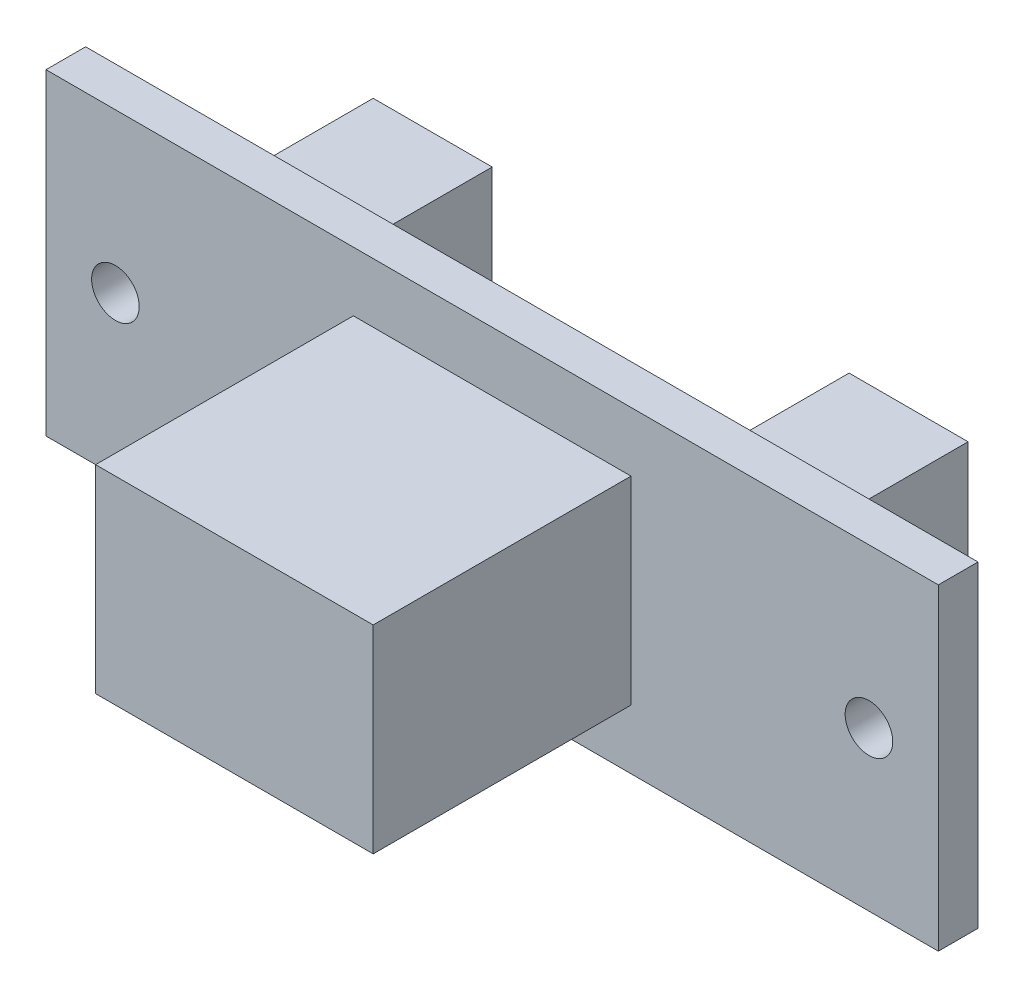
ISO-10303-21;
HEADER;
FILE_DESCRIPTION(('STEP AP214'),'2;1');
FILE_NAME('part.step','',(''),(''),'','','');
FILE_SCHEMA(('AUTOMOTIVE_DESIGN { 1 0 10303 214 1 1 1 1 }'));
ENDSEC;
DATA;
#1=APPLICATION_CONTEXT('core data for automotive mechanical design processes');
#2=APPLICATION_PROTOCOL_DEFINITION('international standard','automotive_design',2000,#1);
#3=PRODUCT_CONTEXT('',#1,'mechanical');
#4=PRODUCT('Part','Part','',(#3));
#5=PRODUCT_RELATED_PRODUCT_CATEGORY('part','',(#4));
#6=PRODUCT_DEFINITION_FORMATION('','',#4);
#7=PRODUCT_DEFINITION_CONTEXT('part definition',#1,'design');
#8=PRODUCT_DEFINITION('design','',#6,#7);
#9=PRODUCT_DEFINITION_SHAPE('','',#8);
#10=(LENGTH_UNIT() NAMED_UNIT(*) SI_UNIT(.MILLI.,.METRE.));
#11=(NAMED_UNIT(*) PLANE_ANGLE_UNIT() SI_UNIT($,.RADIAN.));
#12=(NAMED_UNIT(*) SI_UNIT($,.STERADIAN.) SOLID_ANGLE_UNIT());
#13=UNCERTAINTY_MEASURE_WITH_UNIT(LENGTH_MEASURE(1.E-05),#10,'distance_accuracy_value','');
#14=(GEOMETRIC_REPRESENTATION_CONTEXT(3) GLOBAL_UNCERTAINTY_ASSIGNED_CONTEXT((#13)) GLOBAL_UNIT_ASSIGNED_CONTEXT((#10,
#11,#12)) REPRESENTATION_CONTEXT('',''));
#15=CARTESIAN_POINT('',(0.,0.,0.));
#16=DIRECTION('',(0.,0.,1.));
#17=DIRECTION('',(1.,0.,0.));
#18=AXIS2_PLACEMENT_3D('',#15,#16,#17);
#19=CARTESIAN_POINT('',(0.,0.,2.));
#20=DIRECTION('',(0.,0.,-1.));
#21=DIRECTION('',(-1.,0.,0.));
#22=AXIS2_PLACEMENT_3D('',#19,#20,#21);
#23=PLANE('',#22);
#24=DIRECTION('',(0.,-1.,0.));
#25=VECTOR('',#24,1.);
#26=CARTESIAN_POINT('',(-22.5,8.,2.));
#27=LINE('',#26,#25);
#28=CARTESIAN_POINT('',(-22.5,8.,2.));
#29=VERTEX_POINT('',#28);
#30=CARTESIAN_POINT('',(-22.5,-8.,2.));
#31=VERTEX_POINT('',#30);
#32=EDGE_CURVE('E285',#29,#31,#27,.T.);
#33=ORIENTED_EDGE('',*,*,#32,.T.);
#34=DIRECTION('',(1.,0.,0.));
#35=VECTOR('',#34,1.);
#36=CARTESIAN_POINT('',(22.5,-8.,2.));
#37=LINE('',#36,#35);
#38=CARTESIAN_POINT('',(22.5,-8.,2.));
#39=VERTEX_POINT('',#38);
#40=EDGE_CURVE('E289',#31,#39,#37,.T.);
#41=ORIENTED_EDGE('',*,*,#40,.T.);
#42=DIRECTION('',(0.,1.,0.));
#43=VECTOR('',#42,1.);
#44=CARTESIAN_POINT('',(22.5,8.,2.));
#45=LINE('',#44,#43);
#46=CARTESIAN_POINT('',(22.5,8.,2.));
#47=VERTEX_POINT('',#46);
#48=EDGE_CURVE('E293',#39,#47,#45,.T.);
#49=ORIENTED_EDGE('',*,*,#48,.T.);
#50=DIRECTION('',(-1.,0.,0.));
#51=VECTOR('',#50,1.);
#52=CARTESIAN_POINT('',(22.5,8.,2.));
#53=LINE('',#52,#51);
#54=EDGE_CURVE('E296',#47,#29,#53,.T.);
#55=ORIENTED_EDGE('',*,*,#54,.T.);
#56=EDGE_LOOP('',(#33,#41,#49,#55));
#57=FACE_BOUND('',#56,.T.);
#58=CARTESIAN_POINT('',(19.,0.,2.));
#59=DIRECTION('',(0.,0.,1.));
#60=DIRECTION('',(-1.,0.,0.));
#61=AXIS2_PLACEMENT_3D('',#58,#59,#60);
#62=CIRCLE('',#61,1.2);
#63=CARTESIAN_POINT('',(17.8,0.,2.));
#64=VERTEX_POINT('',#63);
#65=EDGE_CURVE('E268',#64,#64,#62,.T.);
#66=ORIENTED_EDGE('',*,*,#65,.F.);
#67=EDGE_LOOP('',(#66));
#68=FACE_BOUND('',#67,.T.);
#69=CARTESIAN_POINT('',(-19.,0.,2.));
#70=DIRECTION('',(0.,0.,1.));
#71=DIRECTION('',(1.,0.,0.));
#72=AXIS2_PLACEMENT_3D('',#69,#70,#71);
#73=CIRCLE('',#72,1.2);
#74=CARTESIAN_POINT('',(-17.8,0.,2.));
#75=VERTEX_POINT('',#74);
#76=EDGE_CURVE('E274',#75,#75,#73,.T.);
#77=ORIENTED_EDGE('',*,*,#76,.F.);
#78=EDGE_LOOP('',(#77));
#79=FACE_BOUND('',#78,.T.);
#80=DIRECTION('',(0.,1.,0.));
#81=VECTOR('',#80,1.);
#82=CARTESIAN_POINT('',(7.,5.,2.));
#83=LINE('',#82,#81);
#84=CARTESIAN_POINT('',(7.,-5.,2.));
#85=VERTEX_POINT('',#84);
#86=CARTESIAN_POINT('',(7.,5.,2.));
#87=VERTEX_POINT('',#86);
#88=EDGE_CURVE('E212',#85,#87,#83,.T.);
#89=ORIENTED_EDGE('',*,*,#88,.F.);
#90=DIRECTION('',(1.,0.,0.));
#91=VECTOR('',#90,1.);
#92=CARTESIAN_POINT('',(-7.,-5.,2.));
#93=LINE('',#92,#91);
#94=CARTESIAN_POINT('',(-7.,-5.,2.));
#95=VERTEX_POINT('',#94);
#96=EDGE_CURVE('E229',#95,#85,#93,.T.);
#97=ORIENTED_EDGE('',*,*,#96,.F.);
#98=DIRECTION('',(0.,-1.,0.));
#99=VECTOR('',#98,1.);
#100=CARTESIAN_POINT('',(-7.,5.,2.));
#101=LINE('',#100,#99);
#102=CARTESIAN_POINT('',(-7.,5.,2.));
#103=VERTEX_POINT('',#102);
#104=EDGE_CURVE('E246',#103,#95,#101,.T.);
#105=ORIENTED_EDGE('',*,*,#104,.F.);
#106=DIRECTION('',(-1.,0.,0.));
#107=VECTOR('',#106,1.);
#108=CARTESIAN_POINT('',(-7.,5.,2.));
#109=LINE('',#108,#107);
#110=EDGE_CURVE('E242',#87,#103,#109,.T.);
#111=ORIENTED_EDGE('',*,*,#110,.F.);
#112=EDGE_LOOP('',(#89,#97,#105,#111));
#113=FACE_BOUND('',#112,.T.);
#114=ADVANCED_FACE('F39',(#57,#68,#79,#113),#23,.F.);
#115=CARTESIAN_POINT('',(-22.5,8.,2.));
#116=DIRECTION('',(1.,0.,0.));
#117=DIRECTION('',(0.,0.,-1.));
#118=AXIS2_PLACEMENT_3D('',#115,#116,#117);
#119=PLANE('',#118);
#120=DIRECTION('',(0.,-1.,0.));
#121=VECTOR('',#120,1.);
#122=CARTESIAN_POINT('',(-22.5,8.,0.));
#123=LINE('',#122,#121);
#124=CARTESIAN_POINT('',(-22.5,8.,0.));
#125=VERTEX_POINT('',#124);
#126=CARTESIAN_POINT('',(-22.5,-8.,0.));
#127=VERTEX_POINT('',#126);
#128=EDGE_CURVE('E273',#125,#127,#123,.T.);
#129=ORIENTED_EDGE('',*,*,#128,.T.);
#130=DIRECTION('',(0.,0.,-1.));
#131=VECTOR('',#130,1.);
#132=CARTESIAN_POINT('',(-22.5,-8.,2.));
#133=LINE('',#132,#131);
#134=EDGE_CURVE('E322',#31,#127,#133,.T.);
#135=ORIENTED_EDGE('',*,*,#134,.F.);
#136=ORIENTED_EDGE('',*,*,#32,.F.);
#137=DIRECTION('',(0.,0.,-1.));
#138=VECTOR('',#137,1.);
#139=CARTESIAN_POINT('',(-22.5,8.,2.));
#140=LINE('',#139,#138);
#141=EDGE_CURVE('E299',#29,#125,#140,.T.);
#142=ORIENTED_EDGE('',*,*,#141,.T.);
#143=EDGE_LOOP('',(#129,#135,#136,#142));
#144=FACE_BOUND('',#143,.T.);
#145=ADVANCED_FACE('F41',(#144),#119,.F.);
#146=CARTESIAN_POINT('',(22.5,-8.,2.));
#147=DIRECTION('',(0.,1.,0.));
#148=DIRECTION('',(-1.,0.,0.));
#149=AXIS2_PLACEMENT_3D('',#146,#147,#148);
#150=PLANE('',#149);
#151=DIRECTION('',(1.,0.,0.));
#152=VECTOR('',#151,1.);
#153=CARTESIAN_POINT('',(22.5,-8.,0.));
#154=LINE('',#153,#152);
#155=CARTESIAN_POINT('',(22.5,-8.,0.));
#156=VERTEX_POINT('',#155);
#157=EDGE_CURVE('E303',#127,#156,#154,.T.);
#158=ORIENTED_EDGE('',*,*,#157,.T.);
#159=DIRECTION('',(0.,0.,-1.));
#160=VECTOR('',#159,1.);
#161=CARTESIAN_POINT('',(22.5,-8.,2.));
#162=LINE('',#161,#160);
#163=EDGE_CURVE('E318',#39,#156,#162,.T.);
#164=ORIENTED_EDGE('',*,*,#163,.F.);
#165=ORIENTED_EDGE('',*,*,#40,.F.);
#166=ORIENTED_EDGE('',*,*,#134,.T.);
#167=EDGE_LOOP('',(#158,#164,#165,#166));
#168=FACE_BOUND('',#167,.T.);
#169=ADVANCED_FACE('F364',(#168),#150,.F.);
#170=CARTESIAN_POINT('',(22.5,8.,2.));
#171=DIRECTION('',(-1.,0.,0.));
#172=DIRECTION('',(0.,-1.,0.));
#173=AXIS2_PLACEMENT_3D('',#170,#171,#172);
#174=PLANE('',#173);
#175=DIRECTION('',(0.,1.,0.));
#176=VECTOR('',#175,1.);
#177=CARTESIAN_POINT('',(22.5,8.,0.));
#178=LINE('',#177,#176);
#179=CARTESIAN_POINT('',(22.5,8.,0.));
#180=VERTEX_POINT('',#179);
#181=EDGE_CURVE('E306',#156,#180,#178,.T.);
#182=ORIENTED_EDGE('',*,*,#181,.T.);
#183=DIRECTION('',(0.,0.,-1.));
#184=VECTOR('',#183,1.);
#185=CARTESIAN_POINT('',(22.5,8.,2.));
#186=LINE('',#185,#184);
#187=EDGE_CURVE('E314',#47,#180,#186,.T.);
#188=ORIENTED_EDGE('',*,*,#187,.F.);
#189=ORIENTED_EDGE('',*,*,#48,.F.);
#190=ORIENTED_EDGE('',*,*,#163,.T.);
#191=EDGE_LOOP('',(#182,#188,#189,#190));
#192=FACE_BOUND('',#191,.T.);
#193=ADVANCED_FACE('F377',(#192),#174,.F.);
#194=CARTESIAN_POINT('',(22.5,8.,2.));
#195=DIRECTION('',(0.,-1.,0.));
#196=DIRECTION('',(1.,0.,0.));
#197=AXIS2_PLACEMENT_3D('',#194,#195,#196);
#198=PLANE('',#197);
#199=DIRECTION('',(-1.,0.,0.));
#200=VECTOR('',#199,1.);
#201=CARTESIAN_POINT('',(22.5,8.,0.));
#202=LINE('',#201,#200);
#203=EDGE_CURVE('E290',#180,#125,#202,.T.);
#204=ORIENTED_EDGE('',*,*,#203,.T.);
#205=ORIENTED_EDGE('',*,*,#141,.F.);
#206=ORIENTED_EDGE('',*,*,#54,.F.);
#207=ORIENTED_EDGE('',*,*,#187,.T.);
#208=EDGE_LOOP('',(#204,#205,#206,#207));
#209=FACE_BOUND('',#208,.T.);
#210=ADVANCED_FACE('F374',(#209),#198,.F.);
#211=CARTESIAN_POINT('',(0.,0.,0.));
#212=DIRECTION('',(0.,0.,-1.));
#213=DIRECTION('',(-1.,0.,0.));
#214=AXIS2_PLACEMENT_3D('',#211,#212,#213);
#215=PLANE('',#214);
#216=DIRECTION('',(0.,1.,0.));
#217=VECTOR('',#216,1.);
#218=CARTESIAN_POINT('',(9.,0.,0.));
#219=LINE('',#218,#217);
#220=CARTESIAN_POINT('',(8.99999999999999,-6.00000000000002,0.));
#221=VERTEX_POINT('',#220);
#222=CARTESIAN_POINT('',(9.00000000000001,5.99999999999998,0.));
#223=VERTEX_POINT('',#222);
#224=EDGE_CURVE('E11',#221,#223,#219,.T.);
#225=ORIENTED_EDGE('',*,*,#224,.F.);
#226=DIRECTION('',(-1.,0.,0.));
#227=VECTOR('',#226,1.);
#228=CARTESIAN_POINT('',(0.,-6.,0.));
#229=LINE('',#228,#227);
#230=CARTESIAN_POINT('',(15.,-6.00000000000003,0.));
#231=VERTEX_POINT('',#230);
#232=EDGE_CURVE('E155',#231,#221,#229,.T.);
#233=ORIENTED_EDGE('',*,*,#232,.F.);
#234=DIRECTION('',(0.,-1.,0.));
#235=VECTOR('',#234,1.);
#236=CARTESIAN_POINT('',(15.,0.,0.));
#237=LINE('',#236,#235);
#238=CARTESIAN_POINT('',(15.,5.99999999999997,0.));
#239=VERTEX_POINT('',#238);
#240=EDGE_CURVE('E58',#239,#231,#237,.T.);
#241=ORIENTED_EDGE('',*,*,#240,.F.);
#242=DIRECTION('',(1.,0.,0.));
#243=VECTOR('',#242,1.);
#244=CARTESIAN_POINT('',(0.,6.,0.));
#245=LINE('',#244,#243);
#246=EDGE_CURVE('E48',#223,#239,#245,.T.);
#247=ORIENTED_EDGE('',*,*,#246,.F.);
#248=EDGE_LOOP('',(#225,#233,#241,#247));
#249=FACE_BOUND('',#248,.T.);
#250=DIRECTION('',(0.,1.,0.));
#251=VECTOR('',#250,1.);
#252=CARTESIAN_POINT('',(-15.,0.,0.));
#253=LINE('',#252,#251);
#254=CARTESIAN_POINT('',(-15.,-6.,0.));
#255=VERTEX_POINT('',#254);
#256=CARTESIAN_POINT('',(-15.,6.,0.));
#257=VERTEX_POINT('',#256);
#258=EDGE_CURVE('E338',#255,#257,#253,.T.);
#259=ORIENTED_EDGE('',*,*,#258,.F.);
#260=DIRECTION('',(-1.,0.,0.));
#261=VECTOR('',#260,1.);
#262=CARTESIAN_POINT('',(0.,-6.,0.));
#263=LINE('',#262,#261);
#264=CARTESIAN_POINT('',(-9.,-6.,0.));
#265=VERTEX_POINT('',#264);
#266=EDGE_CURVE('E326',#265,#255,#263,.T.);
#267=ORIENTED_EDGE('',*,*,#266,.F.);
#268=DIRECTION('',(0.,-1.,0.));
#269=VECTOR('',#268,1.);
#270=CARTESIAN_POINT('',(-9.,0.,0.));
#271=LINE('',#270,#269);
#272=CARTESIAN_POINT('',(-9.,5.99999999999999,0.));
#273=VERTEX_POINT('',#272);
#274=EDGE_CURVE('E330',#273,#265,#271,.T.);
#275=ORIENTED_EDGE('',*,*,#274,.F.);
#276=DIRECTION('',(1.,0.,0.));
#277=VECTOR('',#276,1.);
#278=CARTESIAN_POINT('',(0.,6.,0.));
#279=LINE('',#278,#277);
#280=EDGE_CURVE('E334',#257,#273,#279,.T.);
#281=ORIENTED_EDGE('',*,*,#280,.F.);
#282=EDGE_LOOP('',(#259,#267,#275,#281));
#283=FACE_BOUND('',#282,.T.);
#284=CARTESIAN_POINT('',(-19.,0.,0.));
#285=DIRECTION('',(0.,0.,1.));
#286=DIRECTION('',(1.,0.,0.));
#287=AXIS2_PLACEMENT_3D('',#284,#285,#286);
#288=CIRCLE('',#287,1.2);
#289=CARTESIAN_POINT('',(-17.8,0.,0.));
#290=VERTEX_POINT('',#289);
#291=EDGE_CURVE('E269',#290,#290,#288,.T.);
#292=ORIENTED_EDGE('',*,*,#291,.T.);
#293=EDGE_LOOP('',(#292));
#294=FACE_BOUND('',#293,.T.);
#295=CARTESIAN_POINT('',(19.,0.,0.));
#296=DIRECTION('',(0.,0.,1.));
#297=DIRECTION('',(-1.,0.,0.));
#298=AXIS2_PLACEMENT_3D('',#295,#296,#297);
#299=CIRCLE('',#298,1.2);
#300=CARTESIAN_POINT('',(17.8,0.,0.));
#301=VERTEX_POINT('',#300);
#302=EDGE_CURVE('E278',#301,#301,#299,.T.);
#303=ORIENTED_EDGE('',*,*,#302,.T.);
#304=EDGE_LOOP('',(#303));
#305=FACE_BOUND('',#304,.T.);
#306=ORIENTED_EDGE('',*,*,#128,.F.);
#307=ORIENTED_EDGE('',*,*,#203,.F.);
#308=ORIENTED_EDGE('',*,*,#181,.F.);
#309=ORIENTED_EDGE('',*,*,#157,.F.);
#310=EDGE_LOOP('',(#306,#307,#308,#309));
#311=FACE_BOUND('',#310,.T.);
#312=ADVANCED_FACE('F371',(#249,#283,#294,#305,#311),#215,.T.);
#313=CARTESIAN_POINT('',(19.,0.,0.));
#314=DIRECTION('',(0.,0.,1.));
#315=DIRECTION('',(1.,0.,0.));
#316=AXIS2_PLACEMENT_3D('',#313,#314,#315);
#317=CYLINDRICAL_SURFACE('',#316,1.2);
#318=ORIENTED_EDGE('',*,*,#302,.F.);
#319=EDGE_LOOP('',(#318));
#320=FACE_BOUND('',#319,.T.);
#321=ORIENTED_EDGE('',*,*,#65,.T.);
#322=EDGE_LOOP('',(#321));
#323=FACE_BOUND('',#322,.T.);
#324=ADVANCED_FACE('F369',(#320,#323),#317,.F.);
#325=CARTESIAN_POINT('',(-19.,0.,0.));
#326=DIRECTION('',(0.,0.,1.));
#327=DIRECTION('',(1.,0.,0.));
#328=AXIS2_PLACEMENT_3D('',#325,#326,#327);
#329=CYLINDRICAL_SURFACE('',#328,1.2);
#330=ORIENTED_EDGE('',*,*,#291,.F.);
#331=EDGE_LOOP('',(#330));
#332=FACE_BOUND('',#331,.T.);
#333=ORIENTED_EDGE('',*,*,#76,.T.);
#334=EDGE_LOOP('',(#333));
#335=FACE_BOUND('',#334,.T.);
#336=ADVANCED_FACE('F417',(#332,#335),#329,.F.);
#337=CARTESIAN_POINT('',(7.,5.,15.));
#338=DIRECTION('',(-1.,0.,0.));
#339=DIRECTION('',(0.,-1.,0.));
#340=AXIS2_PLACEMENT_3D('',#337,#338,#339);
#341=PLANE('',#340);
#342=ORIENTED_EDGE('',*,*,#88,.T.);
#343=DIRECTION('',(0.,0.,-1.));
#344=VECTOR('',#343,1.);
#345=CARTESIAN_POINT('',(7.,5.,15.));
#346=LINE('',#345,#344);
#347=CARTESIAN_POINT('',(7.,5.,15.));
#348=VERTEX_POINT('',#347);
#349=EDGE_CURVE('E264',#348,#87,#346,.T.);
#350=ORIENTED_EDGE('',*,*,#349,.F.);
#351=DIRECTION('',(0.,1.,0.));
#352=VECTOR('',#351,1.);
#353=CARTESIAN_POINT('',(7.,5.,15.));
#354=LINE('',#353,#352);
#355=CARTESIAN_POINT('',(7.,-5.,15.));
#356=VERTEX_POINT('',#355);
#357=EDGE_CURVE('E224',#356,#348,#354,.T.);
#358=ORIENTED_EDGE('',*,*,#357,.F.);
#359=DIRECTION('',(0.,0.,-1.));
#360=VECTOR('',#359,1.);
#361=CARTESIAN_POINT('',(7.,-5.,15.));
#362=LINE('',#361,#360);
#363=EDGE_CURVE('E238',#356,#85,#362,.T.);
#364=ORIENTED_EDGE('',*,*,#363,.T.);
#365=EDGE_LOOP('',(#342,#350,#358,#364));
#366=FACE_BOUND('',#365,.T.);
#367=ADVANCED_FACE('F424',(#366),#341,.F.);
#368=CARTESIAN_POINT('',(-7.,5.,15.));
#369=DIRECTION('',(0.,-1.,0.));
#370=DIRECTION('',(0.,0.,-1.));
#371=AXIS2_PLACEMENT_3D('',#368,#369,#370);
#372=PLANE('',#371);
#373=ORIENTED_EDGE('',*,*,#110,.T.);
#374=DIRECTION('',(0.,0.,-1.));
#375=VECTOR('',#374,1.);
#376=CARTESIAN_POINT('',(-7.,5.,15.));
#377=LINE('',#376,#375);
#378=CARTESIAN_POINT('',(-7.,5.,15.));
#379=VERTEX_POINT('',#378);
#380=EDGE_CURVE('E260',#379,#103,#377,.T.);
#381=ORIENTED_EDGE('',*,*,#380,.F.);
#382=DIRECTION('',(-1.,0.,0.));
#383=VECTOR('',#382,1.);
#384=CARTESIAN_POINT('',(-7.,5.,15.));
#385=LINE('',#384,#383);
#386=EDGE_CURVE('E228',#348,#379,#385,.T.);
#387=ORIENTED_EDGE('',*,*,#386,.F.);
#388=ORIENTED_EDGE('',*,*,#349,.T.);
#389=EDGE_LOOP('',(#373,#381,#387,#388));
#390=FACE_BOUND('',#389,.T.);
#391=ADVANCED_FACE('F431',(#390),#372,.F.);
#392=CARTESIAN_POINT('',(-7.,5.,15.));
#393=DIRECTION('',(1.,0.,0.));
#394=DIRECTION('',(0.,0.,-1.));
#395=AXIS2_PLACEMENT_3D('',#392,#393,#394);
#396=PLANE('',#395);
#397=ORIENTED_EDGE('',*,*,#104,.T.);
#398=DIRECTION('',(0.,0.,-1.));
#399=VECTOR('',#398,1.);
#400=CARTESIAN_POINT('',(-7.,-5.,15.));
#401=LINE('',#400,#399);
#402=CARTESIAN_POINT('',(-7.,-5.,15.));
#403=VERTEX_POINT('',#402);
#404=EDGE_CURVE('E256',#403,#95,#401,.T.);
#405=ORIENTED_EDGE('',*,*,#404,.F.);
#406=DIRECTION('',(0.,-1.,0.));
#407=VECTOR('',#406,1.);
#408=CARTESIAN_POINT('',(-7.,5.,15.));
#409=LINE('',#408,#407);
#410=EDGE_CURVE('E232',#379,#403,#409,.T.);
#411=ORIENTED_EDGE('',*,*,#410,.F.);
#412=ORIENTED_EDGE('',*,*,#380,.T.);
#413=EDGE_LOOP('',(#397,#405,#411,#412));
#414=FACE_BOUND('',#413,.T.);
#415=ADVANCED_FACE('F439',(#414),#396,.F.);
#416=CARTESIAN_POINT('',(-7.,-5.,15.));
#417=DIRECTION('',(0.,1.,0.));
#418=DIRECTION('',(0.,0.,1.));
#419=AXIS2_PLACEMENT_3D('',#416,#417,#418);
#420=PLANE('',#419);
#421=ORIENTED_EDGE('',*,*,#96,.T.);
#422=ORIENTED_EDGE('',*,*,#363,.F.);
#423=DIRECTION('',(1.,0.,0.));
#424=VECTOR('',#423,1.);
#425=CARTESIAN_POINT('',(-7.,-5.,15.));
#426=LINE('',#425,#424);
#427=EDGE_CURVE('E235',#403,#356,#426,.T.);
#428=ORIENTED_EDGE('',*,*,#427,.F.);
#429=ORIENTED_EDGE('',*,*,#404,.T.);
#430=EDGE_LOOP('',(#421,#422,#428,#429));
#431=FACE_BOUND('',#430,.T.);
#432=ADVANCED_FACE('F447',(#431),#420,.F.);
#433=CARTESIAN_POINT('',(0.,0.,15.));
#434=DIRECTION('',(0.,0.,1.));
#435=DIRECTION('',(1.,0.,0.));
#436=AXIS2_PLACEMENT_3D('',#433,#434,#435);
#437=PLANE('',#436);
#438=ORIENTED_EDGE('',*,*,#357,.T.);
#439=ORIENTED_EDGE('',*,*,#386,.T.);
#440=ORIENTED_EDGE('',*,*,#410,.T.);
#441=ORIENTED_EDGE('',*,*,#427,.T.);
#442=EDGE_LOOP('',(#438,#439,#440,#441));
#443=FACE_BOUND('',#442,.T.);
#444=ADVANCED_FACE('F455',(#443),#437,.T.);
#445=CARTESIAN_POINT('',(-15.,6.,-7.));
#446=DIRECTION('',(-1.,0.,0.));
#447=DIRECTION('',(0.,-1.,0.));
#448=AXIS2_PLACEMENT_3D('',#445,#446,#447);
#449=PLANE('',#448);
#450=DIRECTION('',(0.,0.,1.));
#451=VECTOR('',#450,1.);
#452=CARTESIAN_POINT('',(-15.,-6.,-7.));
#453=LINE('',#452,#451);
#454=CARTESIAN_POINT('',(-15.,-6.,-7.));
#455=VERTEX_POINT('',#454);
#456=EDGE_CURVE('E207',#455,#255,#453,.T.);
#457=ORIENTED_EDGE('',*,*,#456,.T.);
#458=ORIENTED_EDGE('',*,*,#258,.T.);
#459=DIRECTION('',(0.,0.,1.));
#460=VECTOR('',#459,1.);
#461=CARTESIAN_POINT('',(-15.,6.,-7.));
#462=LINE('',#461,#460);
#463=CARTESIAN_POINT('',(-15.,6.,-7.));
#464=VERTEX_POINT('',#463);
#465=EDGE_CURVE('E208',#464,#257,#462,.T.);
#466=ORIENTED_EDGE('',*,*,#465,.F.);
#467=DIRECTION('',(0.,-1.,0.));
#468=VECTOR('',#467,1.);
#469=CARTESIAN_POINT('',(-15.,6.,-7.));
#470=LINE('',#469,#468);
#471=EDGE_CURVE('E185',#464,#455,#470,.T.);
#472=ORIENTED_EDGE('',*,*,#471,.T.);
#473=EDGE_LOOP('',(#457,#458,#466,#472));
#474=FACE_BOUND('',#473,.T.);
#475=ADVANCED_FACE('F463',(#474),#449,.T.);
#476=CARTESIAN_POINT('',(-9.,6.,-7.));
#477=DIRECTION('',(0.,1.,0.));
#478=DIRECTION('',(0.,0.,1.));
#479=AXIS2_PLACEMENT_3D('',#476,#477,#478);
#480=PLANE('',#479);
#481=ORIENTED_EDGE('',*,*,#465,.T.);
#482=ORIENTED_EDGE('',*,*,#280,.T.);
#483=DIRECTION('',(0.,0.,1.));
#484=VECTOR('',#483,1.);
#485=CARTESIAN_POINT('',(-9.,6.,-7.));
#486=LINE('',#485,#484);
#487=CARTESIAN_POINT('',(-9.,6.,-7.));
#488=VERTEX_POINT('',#487);
#489=EDGE_CURVE('E213',#488,#273,#486,.T.);
#490=ORIENTED_EDGE('',*,*,#489,.F.);
#491=DIRECTION('',(-1.,0.,0.));
#492=VECTOR('',#491,1.);
#493=CARTESIAN_POINT('',(-9.,6.,-7.));
#494=LINE('',#493,#492);
#495=EDGE_CURVE('E203',#488,#464,#494,.T.);
#496=ORIENTED_EDGE('',*,*,#495,.T.);
#497=EDGE_LOOP('',(#481,#482,#490,#496));
#498=FACE_BOUND('',#497,.T.);
#499=ADVANCED_FACE('F470',(#498),#480,.T.);
#500=CARTESIAN_POINT('',(-9.,6.,-7.));
#501=DIRECTION('',(1.,0.,0.));
#502=DIRECTION('',(0.,1.,0.));
#503=AXIS2_PLACEMENT_3D('',#500,#501,#502);
#504=PLANE('',#503);
#505=ORIENTED_EDGE('',*,*,#489,.T.);
#506=ORIENTED_EDGE('',*,*,#274,.T.);
#507=DIRECTION('',(0.,0.,1.));
#508=VECTOR('',#507,1.);
#509=CARTESIAN_POINT('',(-9.,-6.,-7.));
#510=LINE('',#509,#508);
#511=CARTESIAN_POINT('',(-9.,-6.,-7.));
#512=VERTEX_POINT('',#511);
#513=EDGE_CURVE('E217',#512,#265,#510,.T.);
#514=ORIENTED_EDGE('',*,*,#513,.F.);
#515=DIRECTION('',(0.,1.,0.));
#516=VECTOR('',#515,1.);
#517=CARTESIAN_POINT('',(-9.,6.,-7.));
#518=LINE('',#517,#516);
#519=EDGE_CURVE('E199',#512,#488,#518,.T.);
#520=ORIENTED_EDGE('',*,*,#519,.T.);
#521=EDGE_LOOP('',(#505,#506,#514,#520));
#522=FACE_BOUND('',#521,.T.);
#523=ADVANCED_FACE('F478',(#522),#504,.T.);
#524=CARTESIAN_POINT('',(-9.,-6.,-7.));
#525=DIRECTION('',(0.,-1.,0.));
#526=DIRECTION('',(1.,0.,0.));
#527=AXIS2_PLACEMENT_3D('',#524,#525,#526);
#528=PLANE('',#527);
#529=ORIENTED_EDGE('',*,*,#513,.T.);
#530=ORIENTED_EDGE('',*,*,#266,.T.);
#531=ORIENTED_EDGE('',*,*,#456,.F.);
#532=DIRECTION('',(1.,0.,0.));
#533=VECTOR('',#532,1.);
#534=CARTESIAN_POINT('',(-9.,-6.,-7.));
#535=LINE('',#534,#533);
#536=EDGE_CURVE('E195',#455,#512,#535,.T.);
#537=ORIENTED_EDGE('',*,*,#536,.T.);
#538=EDGE_LOOP('',(#529,#530,#531,#537));
#539=FACE_BOUND('',#538,.T.);
#540=ADVANCED_FACE('F486',(#539),#528,.T.);
#541=CARTESIAN_POINT('',(0.,0.,-7.));
#542=DIRECTION('',(0.,0.,-1.));
#543=DIRECTION('',(-1.,0.,0.));
#544=AXIS2_PLACEMENT_3D('',#541,#542,#543);
#545=PLANE('',#544);
#546=ORIENTED_EDGE('',*,*,#471,.F.);
#547=ORIENTED_EDGE('',*,*,#495,.F.);
#548=ORIENTED_EDGE('',*,*,#519,.F.);
#549=ORIENTED_EDGE('',*,*,#536,.F.);
#550=EDGE_LOOP('',(#546,#547,#548,#549));
#551=FACE_BOUND('',#550,.T.);
#552=ADVANCED_FACE('F494',(#551),#545,.T.);
#553=CARTESIAN_POINT('',(9.00000000000001,5.99999999999998,-7.));
#554=DIRECTION('',(-1.,0.,0.));
#555=DIRECTION('',(0.,-1.,0.));
#556=AXIS2_PLACEMENT_3D('',#553,#554,#555);
#557=PLANE('',#556);
#558=DIRECTION('',(0.,0.,1.));
#559=VECTOR('',#558,1.);
#560=CARTESIAN_POINT('',(8.99999999999999,-6.00000000000002,-7.));
#561=LINE('',#560,#559);
#562=CARTESIAN_POINT('',(8.99999999999999,-6.00000000000002,-7.));
#563=VERTEX_POINT('',#562);
#564=EDGE_CURVE('E150',#563,#221,#561,.T.);
#565=ORIENTED_EDGE('',*,*,#564,.T.);
#566=ORIENTED_EDGE('',*,*,#224,.T.);
#567=DIRECTION('',(0.,0.,1.));
#568=VECTOR('',#567,1.);
#569=CARTESIAN_POINT('',(9.00000000000001,5.99999999999998,-7.));
#570=LINE('',#569,#568);
#571=CARTESIAN_POINT('',(9.00000000000001,5.99999999999998,-7.));
#572=VERTEX_POINT('',#571);
#573=EDGE_CURVE('E175',#572,#223,#570,.T.);
#574=ORIENTED_EDGE('',*,*,#573,.F.);
#575=DIRECTION('',(0.,-1.,0.));
#576=VECTOR('',#575,1.);
#577=CARTESIAN_POINT('',(9.00000000000001,5.99999999999998,-7.));
#578=LINE('',#577,#576);
#579=EDGE_CURVE('E167',#572,#563,#578,.T.);
#580=ORIENTED_EDGE('',*,*,#579,.T.);
#581=EDGE_LOOP('',(#565,#566,#574,#580));
#582=FACE_BOUND('',#581,.T.);
#583=ADVANCED_FACE('F173',(#582),#557,.T.);
#584=CARTESIAN_POINT('',(9.00000000000001,5.99999999999998,-7.));
#585=DIRECTION('',(0.,1.,0.));
#586=DIRECTION('',(-1.,0.,0.));
#587=AXIS2_PLACEMENT_3D('',#584,#585,#586);
#588=PLANE('',#587);
#589=ORIENTED_EDGE('',*,*,#573,.T.);
#590=ORIENTED_EDGE('',*,*,#246,.T.);
#591=DIRECTION('',(0.,0.,1.));
#592=VECTOR('',#591,1.);
#593=CARTESIAN_POINT('',(15.,5.99999999999997,-7.));
#594=LINE('',#593,#592);
#595=CARTESIAN_POINT('',(15.,5.99999999999997,-7.));
#596=VERTEX_POINT('',#595);
#597=EDGE_CURVE('E186',#596,#239,#594,.T.);
#598=ORIENTED_EDGE('',*,*,#597,.F.);
#599=DIRECTION('',(-1.,0.,0.));
#600=VECTOR('',#599,1.);
#601=CARTESIAN_POINT('',(9.00000000000001,5.99999999999998,-7.));
#602=LINE('',#601,#600);
#603=EDGE_CURVE('E160',#596,#572,#602,.T.);
#604=ORIENTED_EDGE('',*,*,#603,.T.);
#605=EDGE_LOOP('',(#589,#590,#598,#604));
#606=FACE_BOUND('',#605,.T.);
#607=ADVANCED_FACE('F347',(#606),#588,.T.);
#608=CARTESIAN_POINT('',(15.,5.99999999999997,-7.));
#609=DIRECTION('',(1.,0.,0.));
#610=DIRECTION('',(0.,1.,0.));
#611=AXIS2_PLACEMENT_3D('',#608,#609,#610);
#612=PLANE('',#611);
#613=ORIENTED_EDGE('',*,*,#597,.T.);
#614=ORIENTED_EDGE('',*,*,#240,.T.);
#615=DIRECTION('',(0.,0.,1.));
#616=VECTOR('',#615,1.);
#617=CARTESIAN_POINT('',(15.,-6.00000000000003,-7.));
#618=LINE('',#617,#616);
#619=CARTESIAN_POINT('',(15.,-6.00000000000003,-7.));
#620=VERTEX_POINT('',#619);
#621=EDGE_CURVE('E159',#620,#231,#618,.T.);
#622=ORIENTED_EDGE('',*,*,#621,.F.);
#623=DIRECTION('',(0.,1.,0.));
#624=VECTOR('',#623,1.);
#625=CARTESIAN_POINT('',(15.,5.99999999999997,-7.));
#626=LINE('',#625,#624);
#627=EDGE_CURVE('E170',#620,#596,#626,.T.);
#628=ORIENTED_EDGE('',*,*,#627,.T.);
#629=EDGE_LOOP('',(#613,#614,#622,#628));
#630=FACE_BOUND('',#629,.T.);
#631=ADVANCED_FACE('F349',(#630),#612,.T.);
#632=CARTESIAN_POINT('',(8.99999999999999,-6.00000000000002,-7.));
#633=DIRECTION('',(0.,-1.,0.));
#634=DIRECTION('',(1.,0.,0.));
#635=AXIS2_PLACEMENT_3D('',#632,#633,#634);
#636=PLANE('',#635);
#637=ORIENTED_EDGE('',*,*,#621,.T.);
#638=ORIENTED_EDGE('',*,*,#232,.T.);
#639=ORIENTED_EDGE('',*,*,#564,.F.);
#640=DIRECTION('',(1.,0.,0.));
#641=VECTOR('',#640,1.);
#642=CARTESIAN_POINT('',(8.99999999999999,-6.00000000000002,-7.));
#643=LINE('',#642,#641);
#644=EDGE_CURVE('E154',#563,#620,#643,.T.);
#645=ORIENTED_EDGE('',*,*,#644,.T.);
#646=EDGE_LOOP('',(#637,#638,#639,#645));
#647=FACE_BOUND('',#646,.T.);
#648=ADVANCED_FACE('F153',(#647),#636,.T.);
#649=CARTESIAN_POINT('',(0.,0.,-7.));
#650=DIRECTION('',(0.,0.,1.));
#651=DIRECTION('',(1.,0.,0.));
#652=AXIS2_PLACEMENT_3D('',#649,#650,#651);
#653=PLANE('',#652);
#654=ORIENTED_EDGE('',*,*,#579,.F.);
#655=ORIENTED_EDGE('',*,*,#603,.F.);
#656=ORIENTED_EDGE('',*,*,#627,.F.);
#657=ORIENTED_EDGE('',*,*,#644,.F.);
#658=EDGE_LOOP('',(#654,#655,#656,#657));
#659=FACE_BOUND('',#658,.T.);
#660=ADVANCED_FACE('F165',(#659),#653,.F.);
#661=CLOSED_SHELL('',(#114,#145,#169,#193,#210,#312,#324,#336,#367,#391,#415,#432,#444,#475,
#499,#523,#540,#552,#583,#607,#631,#648,#660));
#662=MANIFOLD_SOLID_BREP('B2',#661);
#663=ADVANCED_BREP_SHAPE_REPRESENTATION('',(#18,#662),#14);
#664=SHAPE_DEFINITION_REPRESENTATION(#9,#663);
ENDSEC;
END-ISO-10303-21;
